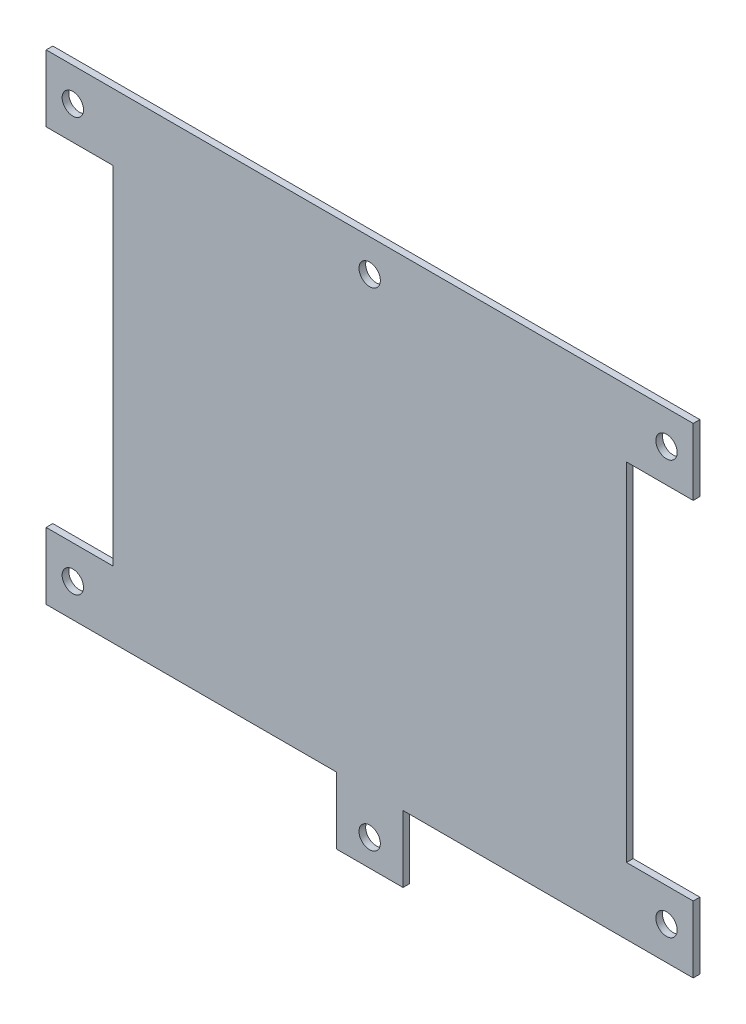
ISO-10303-21;
HEADER;
FILE_DESCRIPTION(('STEP AP214'),'2;1');
FILE_NAME('part.step','',(''),(''),'','','');
FILE_SCHEMA(('AUTOMOTIVE_DESIGN { 1 0 10303 214 1 1 1 1 }'));
ENDSEC;
DATA;
#1=APPLICATION_CONTEXT('core data for automotive mechanical design processes');
#2=APPLICATION_PROTOCOL_DEFINITION('international standard','automotive_design',2000,#1);
#3=PRODUCT_CONTEXT('',#1,'mechanical');
#4=PRODUCT('Part','Part','',(#3));
#5=PRODUCT_RELATED_PRODUCT_CATEGORY('part','',(#4));
#6=PRODUCT_DEFINITION_FORMATION('','',#4);
#7=PRODUCT_DEFINITION_CONTEXT('part definition',#1,'design');
#8=PRODUCT_DEFINITION('design','',#6,#7);
#9=PRODUCT_DEFINITION_SHAPE('','',#8);
#10=(LENGTH_UNIT() NAMED_UNIT(*) SI_UNIT(.MILLI.,.METRE.));
#11=(NAMED_UNIT(*) PLANE_ANGLE_UNIT() SI_UNIT($,.RADIAN.));
#12=(NAMED_UNIT(*) SI_UNIT($,.STERADIAN.) SOLID_ANGLE_UNIT());
#13=UNCERTAINTY_MEASURE_WITH_UNIT(LENGTH_MEASURE(1.E-05),#10,'distance_accuracy_value','');
#14=(GEOMETRIC_REPRESENTATION_CONTEXT(3) GLOBAL_UNCERTAINTY_ASSIGNED_CONTEXT((#13)) GLOBAL_UNIT_ASSIGNED_CONTEXT((#10,
#11,#12)) REPRESENTATION_CONTEXT('',''));
#15=CARTESIAN_POINT('',(0.,0.,0.));
#16=DIRECTION('',(0.,0.,1.));
#17=DIRECTION('',(1.,0.,0.));
#18=AXIS2_PLACEMENT_3D('',#15,#16,#17);
#19=CARTESIAN_POINT('',(0.,0.,1.));
#20=DIRECTION('',(0.,0.,1.));
#21=DIRECTION('',(1.,0.,0.));
#22=AXIS2_PLACEMENT_3D('',#19,#20,#21);
#23=PLANE('',#22);
#24=CARTESIAN_POINT('',(0.,31.1,1.));
#25=DIRECTION('',(0.,0.,1.));
#26=DIRECTION('',(1.,0.,0.));
#27=AXIS2_PLACEMENT_3D('',#24,#25,#26);
#28=CIRCLE('',#27,1.6);
#29=CARTESIAN_POINT('',(1.6,31.1,1.));
#30=VERTEX_POINT('',#29);
#31=EDGE_CURVE('E170',#30,#30,#28,.F.);
#32=ORIENTED_EDGE('',*,*,#31,.T.);
#33=EDGE_LOOP('',(#32));
#34=FACE_BOUND('',#33,.T.);
#35=CARTESIAN_POINT('',(-44.5,-31.,1.));
#36=DIRECTION('',(0.,0.,-1.));
#37=DIRECTION('',(-1.,0.,0.));
#38=AXIS2_PLACEMENT_3D('',#35,#36,#37);
#39=CIRCLE('',#38,1.6);
#40=CARTESIAN_POINT('',(-46.1,-31.,1.));
#41=VERTEX_POINT('',#40);
#42=EDGE_CURVE('E173',#41,#41,#39,.T.);
#43=ORIENTED_EDGE('',*,*,#42,.T.);
#44=EDGE_LOOP('',(#43));
#45=FACE_BOUND('',#44,.T.);
#46=CARTESIAN_POINT('',(0.,-42.,1.));
#47=DIRECTION('',(0.,0.,-1.));
#48=DIRECTION('',(-1.,0.,0.));
#49=AXIS2_PLACEMENT_3D('',#46,#47,#48);
#50=CIRCLE('',#49,1.6);
#51=CARTESIAN_POINT('',(-1.59999999999999,-42.,1.));
#52=VERTEX_POINT('',#51);
#53=EDGE_CURVE('E176',#52,#52,#50,.T.);
#54=ORIENTED_EDGE('',*,*,#53,.T.);
#55=EDGE_LOOP('',(#54));
#56=FACE_BOUND('',#55,.T.);
#57=CARTESIAN_POINT('',(-44.5,31.,1.));
#58=DIRECTION('',(0.,0.,-1.));
#59=DIRECTION('',(-1.,0.,0.));
#60=AXIS2_PLACEMENT_3D('',#57,#58,#59);
#61=CIRCLE('',#60,1.6);
#62=CARTESIAN_POINT('',(-46.1,31.,1.));
#63=VERTEX_POINT('',#62);
#64=EDGE_CURVE('E179',#63,#63,#61,.T.);
#65=ORIENTED_EDGE('',*,*,#64,.T.);
#66=EDGE_LOOP('',(#65));
#67=FACE_BOUND('',#66,.T.);
#68=CARTESIAN_POINT('',(44.5,31.,1.));
#69=DIRECTION('',(0.,0.,-1.));
#70=DIRECTION('',(-1.,0.,0.));
#71=AXIS2_PLACEMENT_3D('',#68,#69,#70);
#72=CIRCLE('',#71,1.6);
#73=CARTESIAN_POINT('',(42.9,31.,1.));
#74=VERTEX_POINT('',#73);
#75=EDGE_CURVE('E181',#74,#74,#72,.T.);
#76=ORIENTED_EDGE('',*,*,#75,.T.);
#77=EDGE_LOOP('',(#76));
#78=FACE_BOUND('',#77,.T.);
#79=CARTESIAN_POINT('',(44.5,-31.,1.));
#80=DIRECTION('',(0.,0.,-1.));
#81=DIRECTION('',(-1.,0.,0.));
#82=AXIS2_PLACEMENT_3D('',#79,#80,#81);
#83=CIRCLE('',#82,1.6);
#84=CARTESIAN_POINT('',(42.9,-31.,1.));
#85=VERTEX_POINT('',#84);
#86=EDGE_CURVE('E19',#85,#85,#83,.T.);
#87=ORIENTED_EDGE('',*,*,#86,.T.);
#88=EDGE_LOOP('',(#87));
#89=FACE_BOUND('',#88,.T.);
#90=DIRECTION('',(1.,0.,0.));
#91=VECTOR('',#90,1.);
#92=CARTESIAN_POINT('',(38.5,26.,1.));
#93=LINE('',#92,#91);
#94=CARTESIAN_POINT('',(48.5,26.,1.));
#95=VERTEX_POINT('',#94);
#96=CARTESIAN_POINT('',(38.5,26.,1.));
#97=VERTEX_POINT('',#96);
#98=EDGE_CURVE('E201',#95,#97,#93,.F.);
#99=ORIENTED_EDGE('',*,*,#98,.F.);
#100=DIRECTION('',(0.,1.,0.));
#101=VECTOR('',#100,1.);
#102=CARTESIAN_POINT('',(48.5,26.,1.));
#103=LINE('',#102,#101);
#104=CARTESIAN_POINT('',(48.5,36.,1.));
#105=VERTEX_POINT('',#104);
#106=EDGE_CURVE('E197',#105,#95,#103,.F.);
#107=ORIENTED_EDGE('',*,*,#106,.F.);
#108=DIRECTION('',(1.,0.,0.));
#109=VECTOR('',#108,1.);
#110=CARTESIAN_POINT('',(-38.5,36.,1.));
#111=LINE('',#110,#109);
#112=CARTESIAN_POINT('',(-48.5,36.,1.));
#113=VERTEX_POINT('',#112);
#114=EDGE_CURVE('E142',#113,#105,#111,.T.);
#115=ORIENTED_EDGE('',*,*,#114,.F.);
#116=DIRECTION('',(0.,-1.,0.));
#117=VECTOR('',#116,1.);
#118=CARTESIAN_POINT('',(-48.5,36.,1.));
#119=LINE('',#118,#117);
#120=CARTESIAN_POINT('',(-48.5,26.,1.));
#121=VERTEX_POINT('',#120);
#122=EDGE_CURVE('E137',#121,#113,#119,.F.);
#123=ORIENTED_EDGE('',*,*,#122,.F.);
#124=DIRECTION('',(1.,0.,0.));
#125=VECTOR('',#124,1.);
#126=CARTESIAN_POINT('',(-48.5,26.,1.));
#127=LINE('',#126,#125);
#128=CARTESIAN_POINT('',(-38.5,26.,1.));
#129=VERTEX_POINT('',#128);
#130=EDGE_CURVE('E127',#129,#121,#127,.F.);
#131=ORIENTED_EDGE('',*,*,#130,.F.);
#132=DIRECTION('',(0.,-1.,0.));
#133=VECTOR('',#132,1.);
#134=CARTESIAN_POINT('',(-38.5,-36.,1.));
#135=LINE('',#134,#133);
#136=CARTESIAN_POINT('',(-38.5,-26.,1.));
#137=VERTEX_POINT('',#136);
#138=EDGE_CURVE('E151',#137,#129,#135,.F.);
#139=ORIENTED_EDGE('',*,*,#138,.F.);
#140=DIRECTION('',(1.,0.,0.));
#141=VECTOR('',#140,1.);
#142=CARTESIAN_POINT('',(-38.5,-26.,1.));
#143=LINE('',#142,#141);
#144=CARTESIAN_POINT('',(-48.5,-26.,1.));
#145=VERTEX_POINT('',#144);
#146=EDGE_CURVE('E243',#145,#137,#143,.T.);
#147=ORIENTED_EDGE('',*,*,#146,.F.);
#148=DIRECTION('',(0.,-1.,0.));
#149=VECTOR('',#148,1.);
#150=CARTESIAN_POINT('',(-48.5,-26.,1.));
#151=LINE('',#150,#149);
#152=CARTESIAN_POINT('',(-48.5,-36.,1.));
#153=VERTEX_POINT('',#152);
#154=EDGE_CURVE('E239',#153,#145,#151,.F.);
#155=ORIENTED_EDGE('',*,*,#154,.F.);
#156=DIRECTION('',(1.,0.,0.));
#157=VECTOR('',#156,1.);
#158=CARTESIAN_POINT('',(38.5,-36.,1.));
#159=LINE('',#158,#157);
#160=CARTESIAN_POINT('',(-5.,-36.,1.));
#161=VERTEX_POINT('',#160);
#162=EDGE_CURVE('E235',#161,#153,#159,.F.);
#163=ORIENTED_EDGE('',*,*,#162,.F.);
#164=DIRECTION('',(0.,-1.,0.));
#165=VECTOR('',#164,1.);
#166=CARTESIAN_POINT('',(-5.,-36.,1.));
#167=LINE('',#166,#165);
#168=CARTESIAN_POINT('',(-5.,-46.,1.));
#169=VERTEX_POINT('',#168);
#170=EDGE_CURVE('E231',#169,#161,#167,.F.);
#171=ORIENTED_EDGE('',*,*,#170,.F.);
#172=DIRECTION('',(1.,0.,0.));
#173=VECTOR('',#172,1.);
#174=CARTESIAN_POINT('',(-4.99999999999999,-46.,1.));
#175=LINE('',#174,#173);
#176=CARTESIAN_POINT('',(5.00000000000001,-46.,1.));
#177=VERTEX_POINT('',#176);
#178=EDGE_CURVE('E227',#177,#169,#175,.F.);
#179=ORIENTED_EDGE('',*,*,#178,.F.);
#180=DIRECTION('',(0.,1.,0.));
#181=VECTOR('',#180,1.);
#182=CARTESIAN_POINT('',(5.00000000000001,-46.,1.));
#183=LINE('',#182,#181);
#184=CARTESIAN_POINT('',(5.00000000000001,-36.,1.));
#185=VERTEX_POINT('',#184);
#186=EDGE_CURVE('E223',#185,#177,#183,.F.);
#187=ORIENTED_EDGE('',*,*,#186,.F.);
#188=DIRECTION('',(1.,0.,0.));
#189=VECTOR('',#188,1.);
#190=CARTESIAN_POINT('',(38.5,-36.,1.));
#191=LINE('',#190,#189);
#192=CARTESIAN_POINT('',(48.5,-36.,1.));
#193=VERTEX_POINT('',#192);
#194=EDGE_CURVE('E216',#193,#185,#191,.F.);
#195=ORIENTED_EDGE('',*,*,#194,.F.);
#196=DIRECTION('',(0.,1.,0.));
#197=VECTOR('',#196,1.);
#198=CARTESIAN_POINT('',(48.5,-36.,1.));
#199=LINE('',#198,#197);
#200=CARTESIAN_POINT('',(48.5,-26.,1.));
#201=VERTEX_POINT('',#200);
#202=EDGE_CURVE('E214',#201,#193,#199,.F.);
#203=ORIENTED_EDGE('',*,*,#202,.F.);
#204=DIRECTION('',(1.,0.,0.));
#205=VECTOR('',#204,1.);
#206=CARTESIAN_POINT('',(48.5,-26.,1.));
#207=LINE('',#206,#205);
#208=CARTESIAN_POINT('',(38.5,-26.,1.));
#209=VERTEX_POINT('',#208);
#210=EDGE_CURVE('E210',#209,#201,#207,.T.);
#211=ORIENTED_EDGE('',*,*,#210,.F.);
#212=DIRECTION('',(0.,1.,0.));
#213=VECTOR('',#212,1.);
#214=CARTESIAN_POINT('',(38.5,36.,1.));
#215=LINE('',#214,#213);
#216=EDGE_CURVE('E203',#97,#209,#215,.F.);
#217=ORIENTED_EDGE('',*,*,#216,.F.);
#218=EDGE_LOOP('',(#99,#107,#115,#123,#131,#139,#147,#155,#163,#171,#179,#187,#195,#203,#211,#217));
#219=FACE_BOUND('',#218,.T.);
#220=ADVANCED_FACE('F16',(#34,#45,#56,#67,#78,#89,#219),#23,.T.);
#221=CARTESIAN_POINT('',(-48.5,36.,1.));
#222=DIRECTION('',(-1.,0.,0.));
#223=DIRECTION('',(0.,-1.,0.));
#224=AXIS2_PLACEMENT_3D('',#221,#222,#223);
#225=PLANE('',#224);
#226=ORIENTED_EDGE('',*,*,#122,.T.);
#227=DIRECTION('',(0.,0.,1.));
#228=VECTOR('',#227,1.);
#229=CARTESIAN_POINT('',(-48.5,36.,0.));
#230=LINE('',#229,#228);
#231=CARTESIAN_POINT('',(-48.5,36.,0.));
#232=VERTEX_POINT('',#231);
#233=EDGE_CURVE('E186',#232,#113,#230,.T.);
#234=ORIENTED_EDGE('',*,*,#233,.F.);
#235=DIRECTION('',(0.,1.,0.));
#236=VECTOR('',#235,1.);
#237=CARTESIAN_POINT('',(-48.5,0.,0.));
#238=LINE('',#237,#236);
#239=CARTESIAN_POINT('',(-48.5,26.,0.));
#240=VERTEX_POINT('',#239);
#241=EDGE_CURVE('E149',#232,#240,#238,.F.);
#242=ORIENTED_EDGE('',*,*,#241,.T.);
#243=DIRECTION('',(0.,0.,-1.));
#244=VECTOR('',#243,1.);
#245=CARTESIAN_POINT('',(-48.5,26.,1.));
#246=LINE('',#245,#244);
#247=EDGE_CURVE('E134',#121,#240,#246,.T.);
#248=ORIENTED_EDGE('',*,*,#247,.F.);
#249=EDGE_LOOP('',(#226,#234,#242,#248));
#250=FACE_BOUND('',#249,.T.);
#251=ADVANCED_FACE('F148',(#250),#225,.T.);
#252=CARTESIAN_POINT('',(-48.5,26.,1.));
#253=DIRECTION('',(0.,-1.,0.));
#254=DIRECTION('',(0.,0.,-1.));
#255=AXIS2_PLACEMENT_3D('',#252,#253,#254);
#256=PLANE('',#255);
#257=ORIENTED_EDGE('',*,*,#130,.T.);
#258=ORIENTED_EDGE('',*,*,#247,.T.);
#259=DIRECTION('',(1.,0.,0.));
#260=VECTOR('',#259,1.);
#261=CARTESIAN_POINT('',(0.,26.,0.));
#262=LINE('',#261,#260);
#263=CARTESIAN_POINT('',(-38.5,26.,0.));
#264=VERTEX_POINT('',#263);
#265=EDGE_CURVE('E278',#240,#264,#262,.T.);
#266=ORIENTED_EDGE('',*,*,#265,.T.);
#267=DIRECTION('',(0.,0.,1.));
#268=VECTOR('',#267,1.);
#269=CARTESIAN_POINT('',(-38.5,26.,0.));
#270=LINE('',#269,#268);
#271=EDGE_CURVE('E136',#129,#264,#270,.F.);
#272=ORIENTED_EDGE('',*,*,#271,.F.);
#273=EDGE_LOOP('',(#257,#258,#266,#272));
#274=FACE_BOUND('',#273,.T.);
#275=ADVANCED_FACE('F131',(#274),#256,.T.);
#276=CARTESIAN_POINT('',(-38.5,-36.,0.));
#277=DIRECTION('',(-1.,0.,0.));
#278=DIRECTION('',(0.,-1.,0.));
#279=AXIS2_PLACEMENT_3D('',#276,#277,#278);
#280=PLANE('',#279);
#281=DIRECTION('',(0.,0.,1.));
#282=VECTOR('',#281,1.);
#283=CARTESIAN_POINT('',(-38.5,-26.,1.));
#284=LINE('',#283,#282);
#285=CARTESIAN_POINT('',(-38.5,-26.,0.));
#286=VERTEX_POINT('',#285);
#287=EDGE_CURVE('E241',#137,#286,#284,.F.);
#288=ORIENTED_EDGE('',*,*,#287,.F.);
#289=ORIENTED_EDGE('',*,*,#138,.T.);
#290=ORIENTED_EDGE('',*,*,#271,.T.);
#291=DIRECTION('',(0.,1.,0.));
#292=VECTOR('',#291,1.);
#293=CARTESIAN_POINT('',(-38.5,0.,0.));
#294=LINE('',#293,#292);
#295=EDGE_CURVE('E274',#264,#286,#294,.F.);
#296=ORIENTED_EDGE('',*,*,#295,.T.);
#297=EDGE_LOOP('',(#288,#289,#290,#296));
#298=FACE_BOUND('',#297,.T.);
#299=ADVANCED_FACE('F246',(#298),#280,.T.);
#300=CARTESIAN_POINT('',(-38.5,-26.,1.));
#301=DIRECTION('',(0.,1.,0.));
#302=DIRECTION('',(0.,0.,1.));
#303=AXIS2_PLACEMENT_3D('',#300,#301,#302);
#304=PLANE('',#303);
#305=ORIENTED_EDGE('',*,*,#146,.T.);
#306=ORIENTED_EDGE('',*,*,#287,.T.);
#307=DIRECTION('',(1.,0.,0.));
#308=VECTOR('',#307,1.);
#309=CARTESIAN_POINT('',(0.,-26.,0.));
#310=LINE('',#309,#308);
#311=CARTESIAN_POINT('',(-48.5,-26.,0.));
#312=VERTEX_POINT('',#311);
#313=EDGE_CURVE('E258',#286,#312,#310,.F.);
#314=ORIENTED_EDGE('',*,*,#313,.T.);
#315=DIRECTION('',(0.,0.,1.));
#316=VECTOR('',#315,1.);
#317=CARTESIAN_POINT('',(-48.5,-26.,1.));
#318=LINE('',#317,#316);
#319=EDGE_CURVE('E237',#145,#312,#318,.F.);
#320=ORIENTED_EDGE('',*,*,#319,.F.);
#321=EDGE_LOOP('',(#305,#306,#314,#320));
#322=FACE_BOUND('',#321,.T.);
#323=ADVANCED_FACE('F256',(#322),#304,.T.);
#324=CARTESIAN_POINT('',(-48.5,-26.,1.));
#325=DIRECTION('',(-1.,0.,0.));
#326=DIRECTION('',(0.,-1.,0.));
#327=AXIS2_PLACEMENT_3D('',#324,#325,#326);
#328=PLANE('',#327);
#329=ORIENTED_EDGE('',*,*,#154,.T.);
#330=ORIENTED_EDGE('',*,*,#319,.T.);
#331=DIRECTION('',(0.,1.,0.));
#332=VECTOR('',#331,1.);
#333=CARTESIAN_POINT('',(-48.5,0.,0.));
#334=LINE('',#333,#332);
#335=CARTESIAN_POINT('',(-48.5,-36.,0.));
#336=VERTEX_POINT('',#335);
#337=EDGE_CURVE('E263',#312,#336,#334,.F.);
#338=ORIENTED_EDGE('',*,*,#337,.T.);
#339=DIRECTION('',(0.,0.,1.));
#340=VECTOR('',#339,1.);
#341=CARTESIAN_POINT('',(-48.5,-36.,0.));
#342=LINE('',#341,#340);
#343=EDGE_CURVE('E233',#153,#336,#342,.F.);
#344=ORIENTED_EDGE('',*,*,#343,.F.);
#345=EDGE_LOOP('',(#329,#330,#338,#344));
#346=FACE_BOUND('',#345,.T.);
#347=ADVANCED_FACE('F262',(#346),#328,.T.);
#348=CARTESIAN_POINT('',(38.5,-36.,0.));
#349=DIRECTION('',(0.,-1.,0.));
#350=DIRECTION('',(1.,0.,0.));
#351=AXIS2_PLACEMENT_3D('',#348,#349,#350);
#352=PLANE('',#351);
#353=ORIENTED_EDGE('',*,*,#343,.T.);
#354=DIRECTION('',(1.,0.,0.));
#355=VECTOR('',#354,1.);
#356=CARTESIAN_POINT('',(0.,-36.,0.));
#357=LINE('',#356,#355);
#358=CARTESIAN_POINT('',(-5.,-36.,0.));
#359=VERTEX_POINT('',#358);
#360=EDGE_CURVE('E270',#336,#359,#357,.T.);
#361=ORIENTED_EDGE('',*,*,#360,.T.);
#362=DIRECTION('',(0.,0.,1.));
#363=VECTOR('',#362,1.);
#364=CARTESIAN_POINT('',(-5.,-36.,1.));
#365=LINE('',#364,#363);
#366=EDGE_CURVE('E229',#161,#359,#365,.F.);
#367=ORIENTED_EDGE('',*,*,#366,.F.);
#368=ORIENTED_EDGE('',*,*,#162,.T.);
#369=EDGE_LOOP('',(#353,#361,#367,#368));
#370=FACE_BOUND('',#369,.T.);
#371=ADVANCED_FACE('F313',(#370),#352,.T.);
#372=CARTESIAN_POINT('',(-5.,-36.,1.));
#373=DIRECTION('',(-1.,0.,0.));
#374=DIRECTION('',(0.,-1.,0.));
#375=AXIS2_PLACEMENT_3D('',#372,#373,#374);
#376=PLANE('',#375);
#377=ORIENTED_EDGE('',*,*,#170,.T.);
#378=ORIENTED_EDGE('',*,*,#366,.T.);
#379=DIRECTION('',(0.,1.,0.));
#380=VECTOR('',#379,1.);
#381=CARTESIAN_POINT('',(-5.,0.,0.));
#382=LINE('',#381,#380);
#383=CARTESIAN_POINT('',(-4.99999999999999,-46.,0.));
#384=VERTEX_POINT('',#383);
#385=EDGE_CURVE('E272',#359,#384,#382,.F.);
#386=ORIENTED_EDGE('',*,*,#385,.T.);
#387=DIRECTION('',(0.,0.,-1.));
#388=VECTOR('',#387,1.);
#389=CARTESIAN_POINT('',(-4.99999999999999,-46.,1.));
#390=LINE('',#389,#388);
#391=EDGE_CURVE('E225',#169,#384,#390,.T.);
#392=ORIENTED_EDGE('',*,*,#391,.F.);
#393=EDGE_LOOP('',(#377,#378,#386,#392));
#394=FACE_BOUND('',#393,.T.);
#395=ADVANCED_FACE('F308',(#394),#376,.T.);
#396=CARTESIAN_POINT('',(-4.99999999999999,-46.,1.));
#397=DIRECTION('',(0.,-1.,0.));
#398=DIRECTION('',(0.,0.,-1.));
#399=AXIS2_PLACEMENT_3D('',#396,#397,#398);
#400=PLANE('',#399);
#401=ORIENTED_EDGE('',*,*,#178,.T.);
#402=ORIENTED_EDGE('',*,*,#391,.T.);
#403=DIRECTION('',(1.,0.,0.));
#404=VECTOR('',#403,1.);
#405=CARTESIAN_POINT('',(0.,-46.,0.));
#406=LINE('',#405,#404);
#407=CARTESIAN_POINT('',(5.00000000000001,-46.,0.));
#408=VERTEX_POINT('',#407);
#409=EDGE_CURVE('E303',#384,#408,#406,.T.);
#410=ORIENTED_EDGE('',*,*,#409,.T.);
#411=DIRECTION('',(0.,0.,-1.));
#412=VECTOR('',#411,1.);
#413=CARTESIAN_POINT('',(5.00000000000001,-46.,1.));
#414=LINE('',#413,#412);
#415=EDGE_CURVE('E221',#177,#408,#414,.T.);
#416=ORIENTED_EDGE('',*,*,#415,.F.);
#417=EDGE_LOOP('',(#401,#402,#410,#416));
#418=FACE_BOUND('',#417,.T.);
#419=ADVANCED_FACE('F319',(#418),#400,.T.);
#420=CARTESIAN_POINT('',(5.00000000000001,-46.,1.));
#421=DIRECTION('',(1.,0.,0.));
#422=DIRECTION('',(0.,0.,-1.));
#423=AXIS2_PLACEMENT_3D('',#420,#421,#422);
#424=PLANE('',#423);
#425=ORIENTED_EDGE('',*,*,#186,.T.);
#426=ORIENTED_EDGE('',*,*,#415,.T.);
#427=DIRECTION('',(0.,1.,0.));
#428=VECTOR('',#427,1.);
#429=CARTESIAN_POINT('',(5.00000000000001,0.,0.));
#430=LINE('',#429,#428);
#431=CARTESIAN_POINT('',(5.00000000000001,-36.,0.));
#432=VERTEX_POINT('',#431);
#433=EDGE_CURVE('E300',#408,#432,#430,.T.);
#434=ORIENTED_EDGE('',*,*,#433,.T.);
#435=DIRECTION('',(0.,0.,1.));
#436=VECTOR('',#435,1.);
#437=CARTESIAN_POINT('',(5.00000000000001,-36.,0.));
#438=LINE('',#437,#436);
#439=EDGE_CURVE('E219',#185,#432,#438,.F.);
#440=ORIENTED_EDGE('',*,*,#439,.F.);
#441=EDGE_LOOP('',(#425,#426,#434,#440));
#442=FACE_BOUND('',#441,.T.);
#443=ADVANCED_FACE('F321',(#442),#424,.T.);
#444=CARTESIAN_POINT('',(38.5,-36.,0.));
#445=DIRECTION('',(0.,-1.,0.));
#446=DIRECTION('',(1.,0.,0.));
#447=AXIS2_PLACEMENT_3D('',#444,#445,#446);
#448=PLANE('',#447);
#449=DIRECTION('',(0.,0.,1.));
#450=VECTOR('',#449,1.);
#451=CARTESIAN_POINT('',(48.5,-36.,1.));
#452=LINE('',#451,#450);
#453=CARTESIAN_POINT('',(48.5,-36.,0.));
#454=VERTEX_POINT('',#453);
#455=EDGE_CURVE('E212',#193,#454,#452,.F.);
#456=ORIENTED_EDGE('',*,*,#455,.F.);
#457=ORIENTED_EDGE('',*,*,#194,.T.);
#458=ORIENTED_EDGE('',*,*,#439,.T.);
#459=DIRECTION('',(1.,0.,0.));
#460=VECTOR('',#459,1.);
#461=CARTESIAN_POINT('',(0.,-36.,0.));
#462=LINE('',#461,#460);
#463=EDGE_CURVE('E297',#432,#454,#462,.T.);
#464=ORIENTED_EDGE('',*,*,#463,.T.);
#465=EDGE_LOOP('',(#456,#457,#458,#464));
#466=FACE_BOUND('',#465,.T.);
#467=ADVANCED_FACE('F328',(#466),#448,.T.);
#468=CARTESIAN_POINT('',(48.5,-36.,1.));
#469=DIRECTION('',(1.,0.,0.));
#470=DIRECTION('',(0.,1.,0.));
#471=AXIS2_PLACEMENT_3D('',#468,#469,#470);
#472=PLANE('',#471);
#473=ORIENTED_EDGE('',*,*,#202,.T.);
#474=ORIENTED_EDGE('',*,*,#455,.T.);
#475=DIRECTION('',(0.,1.,0.));
#476=VECTOR('',#475,1.);
#477=CARTESIAN_POINT('',(48.5,0.,0.));
#478=LINE('',#477,#476);
#479=CARTESIAN_POINT('',(48.5,-26.,0.));
#480=VERTEX_POINT('',#479);
#481=EDGE_CURVE('E294',#454,#480,#478,.T.);
#482=ORIENTED_EDGE('',*,*,#481,.T.);
#483=DIRECTION('',(0.,0.,1.));
#484=VECTOR('',#483,1.);
#485=CARTESIAN_POINT('',(48.5,-26.,1.));
#486=LINE('',#485,#484);
#487=EDGE_CURVE('E208',#201,#480,#486,.F.);
#488=ORIENTED_EDGE('',*,*,#487,.F.);
#489=EDGE_LOOP('',(#473,#474,#482,#488));
#490=FACE_BOUND('',#489,.T.);
#491=ADVANCED_FACE('F333',(#490),#472,.T.);
#492=CARTESIAN_POINT('',(48.5,-26.,1.));
#493=DIRECTION('',(0.,1.,0.));
#494=DIRECTION('',(0.,0.,1.));
#495=AXIS2_PLACEMENT_3D('',#492,#493,#494);
#496=PLANE('',#495);
#497=ORIENTED_EDGE('',*,*,#210,.T.);
#498=ORIENTED_EDGE('',*,*,#487,.T.);
#499=DIRECTION('',(1.,0.,0.));
#500=VECTOR('',#499,1.);
#501=CARTESIAN_POINT('',(0.,-26.,0.));
#502=LINE('',#501,#500);
#503=CARTESIAN_POINT('',(38.5,-26.,0.));
#504=VERTEX_POINT('',#503);
#505=EDGE_CURVE('E291',#480,#504,#502,.F.);
#506=ORIENTED_EDGE('',*,*,#505,.T.);
#507=DIRECTION('',(0.,0.,-1.));
#508=VECTOR('',#507,1.);
#509=CARTESIAN_POINT('',(38.5,-26.,0.));
#510=LINE('',#509,#508);
#511=EDGE_CURVE('E206',#209,#504,#510,.T.);
#512=ORIENTED_EDGE('',*,*,#511,.F.);
#513=EDGE_LOOP('',(#497,#498,#506,#512));
#514=FACE_BOUND('',#513,.T.);
#515=ADVANCED_FACE('F335',(#514),#496,.T.);
#516=CARTESIAN_POINT('',(38.5,36.,0.));
#517=DIRECTION('',(1.,0.,0.));
#518=DIRECTION('',(0.,0.,-1.));
#519=AXIS2_PLACEMENT_3D('',#516,#517,#518);
#520=PLANE('',#519);
#521=DIRECTION('',(0.,0.,-1.));
#522=VECTOR('',#521,1.);
#523=CARTESIAN_POINT('',(38.5,26.,1.));
#524=LINE('',#523,#522);
#525=CARTESIAN_POINT('',(38.5,26.,0.));
#526=VERTEX_POINT('',#525);
#527=EDGE_CURVE('E199',#97,#526,#524,.T.);
#528=ORIENTED_EDGE('',*,*,#527,.F.);
#529=ORIENTED_EDGE('',*,*,#216,.T.);
#530=ORIENTED_EDGE('',*,*,#511,.T.);
#531=DIRECTION('',(0.,1.,0.));
#532=VECTOR('',#531,1.);
#533=CARTESIAN_POINT('',(38.5,0.,0.));
#534=LINE('',#533,#532);
#535=EDGE_CURVE('E288',#504,#526,#534,.T.);
#536=ORIENTED_EDGE('',*,*,#535,.T.);
#537=EDGE_LOOP('',(#528,#529,#530,#536));
#538=FACE_BOUND('',#537,.T.);
#539=ADVANCED_FACE('F341',(#538),#520,.T.);
#540=CARTESIAN_POINT('',(38.5,26.,1.));
#541=DIRECTION('',(0.,-1.,0.));
#542=DIRECTION('',(0.,0.,-1.));
#543=AXIS2_PLACEMENT_3D('',#540,#541,#542);
#544=PLANE('',#543);
#545=ORIENTED_EDGE('',*,*,#98,.T.);
#546=ORIENTED_EDGE('',*,*,#527,.T.);
#547=DIRECTION('',(1.,0.,0.));
#548=VECTOR('',#547,1.);
#549=CARTESIAN_POINT('',(0.,26.,0.));
#550=LINE('',#549,#548);
#551=CARTESIAN_POINT('',(48.5,26.,0.));
#552=VERTEX_POINT('',#551);
#553=EDGE_CURVE('E283',#526,#552,#550,.T.);
#554=ORIENTED_EDGE('',*,*,#553,.T.);
#555=DIRECTION('',(0.,0.,1.));
#556=VECTOR('',#555,1.);
#557=CARTESIAN_POINT('',(48.5,26.,1.));
#558=LINE('',#557,#556);
#559=EDGE_CURVE('E195',#95,#552,#558,.F.);
#560=ORIENTED_EDGE('',*,*,#559,.F.);
#561=EDGE_LOOP('',(#545,#546,#554,#560));
#562=FACE_BOUND('',#561,.T.);
#563=ADVANCED_FACE('F344',(#562),#544,.T.);
#564=CARTESIAN_POINT('',(48.5,26.,1.));
#565=DIRECTION('',(1.,0.,0.));
#566=DIRECTION('',(0.,1.,0.));
#567=AXIS2_PLACEMENT_3D('',#564,#565,#566);
#568=PLANE('',#567);
#569=ORIENTED_EDGE('',*,*,#106,.T.);
#570=ORIENTED_EDGE('',*,*,#559,.T.);
#571=DIRECTION('',(0.,1.,0.));
#572=VECTOR('',#571,1.);
#573=CARTESIAN_POINT('',(48.5,0.,0.));
#574=LINE('',#573,#572);
#575=CARTESIAN_POINT('',(48.5,36.,0.));
#576=VERTEX_POINT('',#575);
#577=EDGE_CURVE('E281',#552,#576,#574,.T.);
#578=ORIENTED_EDGE('',*,*,#577,.T.);
#579=DIRECTION('',(0.,0.,1.));
#580=VECTOR('',#579,1.);
#581=CARTESIAN_POINT('',(48.5,36.,0.));
#582=LINE('',#581,#580);
#583=EDGE_CURVE('E34',#105,#576,#582,.F.);
#584=ORIENTED_EDGE('',*,*,#583,.F.);
#585=EDGE_LOOP('',(#569,#570,#578,#584));
#586=FACE_BOUND('',#585,.T.);
#587=ADVANCED_FACE('F346',(#586),#568,.T.);
#588=CARTESIAN_POINT('',(-38.5,36.,0.));
#589=DIRECTION('',(0.,1.,0.));
#590=DIRECTION('',(0.,0.,1.));
#591=AXIS2_PLACEMENT_3D('',#588,#589,#590);
#592=PLANE('',#591);
#593=DIRECTION('',(1.,0.,0.));
#594=VECTOR('',#593,1.);
#595=CARTESIAN_POINT('',(0.,36.,0.));
#596=LINE('',#595,#594);
#597=EDGE_CURVE('E169',#576,#232,#596,.F.);
#598=ORIENTED_EDGE('',*,*,#597,.T.);
#599=ORIENTED_EDGE('',*,*,#233,.T.);
#600=ORIENTED_EDGE('',*,*,#114,.T.);
#601=ORIENTED_EDGE('',*,*,#583,.T.);
#602=EDGE_LOOP('',(#598,#599,#600,#601));
#603=FACE_BOUND('',#602,.T.);
#604=ADVANCED_FACE('F280',(#603),#592,.T.);
#605=CARTESIAN_POINT('',(44.5,-31.,1.));
#606=DIRECTION('',(0.,0.,-1.));
#607=DIRECTION('',(-1.,0.,0.));
#608=AXIS2_PLACEMENT_3D('',#605,#606,#607);
#609=CYLINDRICAL_SURFACE('',#608,1.6);
#610=CARTESIAN_POINT('',(44.5,-31.,0.));
#611=DIRECTION('',(0.,0.,-1.));
#612=DIRECTION('',(-1.,0.,0.));
#613=AXIS2_PLACEMENT_3D('',#610,#611,#612);
#614=CIRCLE('',#613,1.6);
#615=CARTESIAN_POINT('',(42.9,-31.,0.));
#616=VERTEX_POINT('',#615);
#617=EDGE_CURVE('E166',#616,#616,#614,.T.);
#618=ORIENTED_EDGE('',*,*,#617,.T.);
#619=EDGE_LOOP('',(#618));
#620=FACE_BOUND('',#619,.T.);
#621=ORIENTED_EDGE('',*,*,#86,.F.);
#622=EDGE_LOOP('',(#621));
#623=FACE_BOUND('',#622,.T.);
#624=ADVANCED_FACE('F354',(#620,#623),#609,.F.);
#625=CARTESIAN_POINT('',(44.5,31.,1.));
#626=DIRECTION('',(0.,0.,-1.));
#627=DIRECTION('',(-1.,0.,0.));
#628=AXIS2_PLACEMENT_3D('',#625,#626,#627);
#629=CYLINDRICAL_SURFACE('',#628,1.6);
#630=CARTESIAN_POINT('',(44.5,31.,0.));
#631=DIRECTION('',(0.,0.,-1.));
#632=DIRECTION('',(-1.,0.,0.));
#633=AXIS2_PLACEMENT_3D('',#630,#631,#632);
#634=CIRCLE('',#633,1.6);
#635=CARTESIAN_POINT('',(42.9,31.,0.));
#636=VERTEX_POINT('',#635);
#637=EDGE_CURVE('E163',#636,#636,#634,.T.);
#638=ORIENTED_EDGE('',*,*,#637,.T.);
#639=EDGE_LOOP('',(#638));
#640=FACE_BOUND('',#639,.T.);
#641=ORIENTED_EDGE('',*,*,#75,.F.);
#642=EDGE_LOOP('',(#641));
#643=FACE_BOUND('',#642,.T.);
#644=ADVANCED_FACE('F380',(#640,#643),#629,.F.);
#645=CARTESIAN_POINT('',(-44.5,31.,1.));
#646=DIRECTION('',(0.,0.,-1.));
#647=DIRECTION('',(-1.,0.,0.));
#648=AXIS2_PLACEMENT_3D('',#645,#646,#647);
#649=CYLINDRICAL_SURFACE('',#648,1.6);
#650=CARTESIAN_POINT('',(-44.5,31.,0.));
#651=DIRECTION('',(0.,0.,-1.));
#652=DIRECTION('',(-1.,0.,0.));
#653=AXIS2_PLACEMENT_3D('',#650,#651,#652);
#654=CIRCLE('',#653,1.6);
#655=CARTESIAN_POINT('',(-46.1,31.,0.));
#656=VERTEX_POINT('',#655);
#657=EDGE_CURVE('E160',#656,#656,#654,.T.);
#658=ORIENTED_EDGE('',*,*,#657,.T.);
#659=EDGE_LOOP('',(#658));
#660=FACE_BOUND('',#659,.T.);
#661=ORIENTED_EDGE('',*,*,#64,.F.);
#662=EDGE_LOOP('',(#661));
#663=FACE_BOUND('',#662,.T.);
#664=ADVANCED_FACE('F376',(#660,#663),#649,.F.);
#665=CARTESIAN_POINT('',(0.,-42.,1.));
#666=DIRECTION('',(0.,0.,-1.));
#667=DIRECTION('',(-1.,0.,0.));
#668=AXIS2_PLACEMENT_3D('',#665,#666,#667);
#669=CYLINDRICAL_SURFACE('',#668,1.6);
#670=CARTESIAN_POINT('',(0.,-42.,0.));
#671=DIRECTION('',(0.,0.,-1.));
#672=DIRECTION('',(-1.,0.,0.));
#673=AXIS2_PLACEMENT_3D('',#670,#671,#672);
#674=CIRCLE('',#673,1.6);
#675=CARTESIAN_POINT('',(-1.59999999999999,-42.,0.));
#676=VERTEX_POINT('',#675);
#677=EDGE_CURVE('E157',#676,#676,#674,.T.);
#678=ORIENTED_EDGE('',*,*,#677,.T.);
#679=EDGE_LOOP('',(#678));
#680=FACE_BOUND('',#679,.T.);
#681=ORIENTED_EDGE('',*,*,#53,.F.);
#682=EDGE_LOOP('',(#681));
#683=FACE_BOUND('',#682,.T.);
#684=ADVANCED_FACE('F372',(#680,#683),#669,.F.);
#685=CARTESIAN_POINT('',(-44.5,-31.,1.));
#686=DIRECTION('',(0.,0.,-1.));
#687=DIRECTION('',(-1.,0.,0.));
#688=AXIS2_PLACEMENT_3D('',#685,#686,#687);
#689=CYLINDRICAL_SURFACE('',#688,1.6);
#690=CARTESIAN_POINT('',(-44.5,-31.,0.));
#691=DIRECTION('',(0.,0.,-1.));
#692=DIRECTION('',(-1.,0.,0.));
#693=AXIS2_PLACEMENT_3D('',#690,#691,#692);
#694=CIRCLE('',#693,1.6);
#695=CARTESIAN_POINT('',(-46.1,-31.,0.));
#696=VERTEX_POINT('',#695);
#697=EDGE_CURVE('E25',#696,#696,#694,.T.);
#698=ORIENTED_EDGE('',*,*,#697,.T.);
#699=EDGE_LOOP('',(#698));
#700=FACE_BOUND('',#699,.T.);
#701=ORIENTED_EDGE('',*,*,#42,.F.);
#702=EDGE_LOOP('',(#701));
#703=FACE_BOUND('',#702,.T.);
#704=ADVANCED_FACE('F364',(#700,#703),#689,.F.);
#705=CARTESIAN_POINT('',(0.,31.1,0.));
#706=DIRECTION('',(0.,0.,1.));
#707=DIRECTION('',(1.,0.,0.));
#708=AXIS2_PLACEMENT_3D('',#705,#706,#707);
#709=CYLINDRICAL_SURFACE('',#708,1.6);
#710=ORIENTED_EDGE('',*,*,#31,.F.);
#711=EDGE_LOOP('',(#710));
#712=FACE_BOUND('',#711,.T.);
#713=CARTESIAN_POINT('',(0.,31.1,0.));
#714=DIRECTION('',(0.,0.,1.));
#715=DIRECTION('',(1.,0.,0.));
#716=AXIS2_PLACEMENT_3D('',#713,#714,#715);
#717=CIRCLE('',#716,1.6);
#718=CARTESIAN_POINT('',(1.6,31.1,0.));
#719=VERTEX_POINT('',#718);
#720=EDGE_CURVE('E11',#719,#719,#717,.F.);
#721=ORIENTED_EDGE('',*,*,#720,.T.);
#722=EDGE_LOOP('',(#721));
#723=FACE_BOUND('',#722,.T.);
#724=ADVANCED_FACE('F358',(#712,#723),#709,.F.);
#725=CARTESIAN_POINT('',(0.,0.,0.));
#726=DIRECTION('',(0.,0.,1.));
#727=DIRECTION('',(1.,0.,0.));
#728=AXIS2_PLACEMENT_3D('',#725,#726,#727);
#729=PLANE('',#728);
#730=ORIENTED_EDGE('',*,*,#720,.F.);
#731=EDGE_LOOP('',(#730));
#732=FACE_BOUND('',#731,.T.);
#733=ORIENTED_EDGE('',*,*,#697,.F.);
#734=EDGE_LOOP('',(#733));
#735=FACE_BOUND('',#734,.T.);
#736=ORIENTED_EDGE('',*,*,#677,.F.);
#737=EDGE_LOOP('',(#736));
#738=FACE_BOUND('',#737,.T.);
#739=ORIENTED_EDGE('',*,*,#657,.F.);
#740=EDGE_LOOP('',(#739));
#741=FACE_BOUND('',#740,.T.);
#742=ORIENTED_EDGE('',*,*,#637,.F.);
#743=EDGE_LOOP('',(#742));
#744=FACE_BOUND('',#743,.T.);
#745=ORIENTED_EDGE('',*,*,#617,.F.);
#746=EDGE_LOOP('',(#745));
#747=FACE_BOUND('',#746,.T.);
#748=ORIENTED_EDGE('',*,*,#577,.F.);
#749=ORIENTED_EDGE('',*,*,#553,.F.);
#750=ORIENTED_EDGE('',*,*,#535,.F.);
#751=ORIENTED_EDGE('',*,*,#505,.F.);
#752=ORIENTED_EDGE('',*,*,#481,.F.);
#753=ORIENTED_EDGE('',*,*,#463,.F.);
#754=ORIENTED_EDGE('',*,*,#433,.F.);
#755=ORIENTED_EDGE('',*,*,#409,.F.);
#756=ORIENTED_EDGE('',*,*,#385,.F.);
#757=ORIENTED_EDGE('',*,*,#360,.F.);
#758=ORIENTED_EDGE('',*,*,#337,.F.);
#759=ORIENTED_EDGE('',*,*,#313,.F.);
#760=ORIENTED_EDGE('',*,*,#295,.F.);
#761=ORIENTED_EDGE('',*,*,#265,.F.);
#762=ORIENTED_EDGE('',*,*,#241,.F.);
#763=ORIENTED_EDGE('',*,*,#597,.F.);
#764=EDGE_LOOP('',(#748,#749,#750,#751,#752,#753,#754,#755,#756,#757,#758,#759,#760,#761,#762,#763));
#765=FACE_BOUND('',#764,.T.);
#766=ADVANCED_FACE('F267',(#732,#735,#738,#741,#744,#747,#765),#729,.F.);
#767=CLOSED_SHELL('',(#220,#251,#275,#299,#323,#347,#371,#395,#419,#443,#467,#491,#515,#539,
#563,#587,#604,#624,#644,#664,#684,#704,#724,#766));
#768=MANIFOLD_SOLID_BREP('B1',#767);
#769=ADVANCED_BREP_SHAPE_REPRESENTATION('',(#18,#768),#14);
#770=SHAPE_DEFINITION_REPRESENTATION(#9,#769);
ENDSEC;
END-ISO-10303-21;
